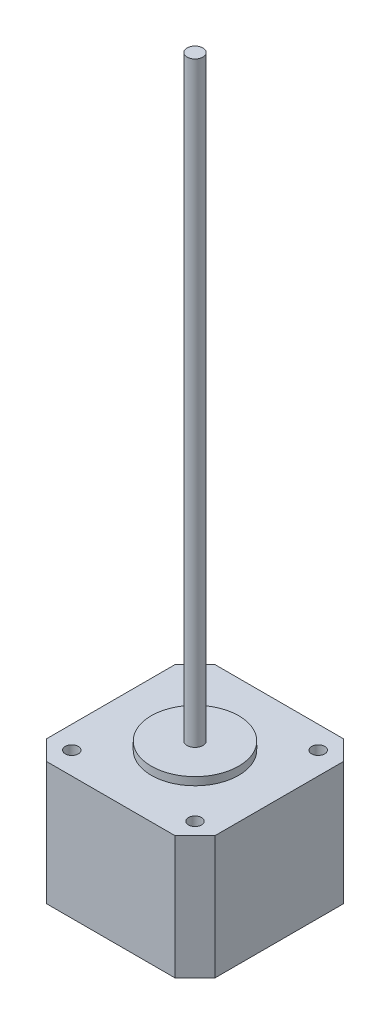
ISO-10303-21;
HEADER;
FILE_DESCRIPTION(('STEP AP214'),'2;1');
FILE_NAME('part.step','',(''),(''),'','','');
FILE_SCHEMA(('AUTOMOTIVE_DESIGN { 1 0 10303 214 1 1 1 1 }'));
ENDSEC;
DATA;
#1=APPLICATION_CONTEXT('core data for automotive mechanical design processes');
#2=APPLICATION_PROTOCOL_DEFINITION('international standard','automotive_design',2000,#1);
#3=PRODUCT_CONTEXT('',#1,'mechanical');
#4=PRODUCT('Part','Part','',(#3));
#5=PRODUCT_RELATED_PRODUCT_CATEGORY('part','',(#4));
#6=PRODUCT_DEFINITION_FORMATION('','',#4);
#7=PRODUCT_DEFINITION_CONTEXT('part definition',#1,'design');
#8=PRODUCT_DEFINITION('design','',#6,#7);
#9=PRODUCT_DEFINITION_SHAPE('','',#8);
#10=(LENGTH_UNIT() NAMED_UNIT(*) SI_UNIT(.MILLI.,.METRE.));
#11=(NAMED_UNIT(*) PLANE_ANGLE_UNIT() SI_UNIT($,.RADIAN.));
#12=(NAMED_UNIT(*) SI_UNIT($,.STERADIAN.) SOLID_ANGLE_UNIT());
#13=UNCERTAINTY_MEASURE_WITH_UNIT(LENGTH_MEASURE(1.E-05),#10,'distance_accuracy_value','');
#14=(GEOMETRIC_REPRESENTATION_CONTEXT(3) GLOBAL_UNCERTAINTY_ASSIGNED_CONTEXT((#13)) GLOBAL_UNIT_ASSIGNED_CONTEXT((#10,
#11,#12)) REPRESENTATION_CONTEXT('',''));
#15=CARTESIAN_POINT('',(0.,0.,0.));
#16=DIRECTION('',(0.,0.,1.));
#17=DIRECTION('',(1.,0.,0.));
#18=AXIS2_PLACEMENT_3D('',#15,#16,#17);
#19=CARTESIAN_POINT('',(0.,0.,-42.3));
#20=DIRECTION('',(0.,-1.,0.));
#21=DIRECTION('',(0.,0.,-1.));
#22=AXIS2_PLACEMENT_3D('',#19,#20,#21);
#23=PLANE('',#22);
#24=DIRECTION('',(0.,0.,-1.));
#25=VECTOR('',#24,1.);
#26=CARTESIAN_POINT('',(42.3,0.,0.));
#27=LINE('',#26,#25);
#28=CARTESIAN_POINT('',(42.3,0.,-4.99999999999999));
#29=VERTEX_POINT('',#28);
#30=CARTESIAN_POINT('',(42.3,0.,-37.3));
#31=VERTEX_POINT('',#30);
#32=EDGE_CURVE('E112',#29,#31,#27,.T.);
#33=ORIENTED_EDGE('',*,*,#32,.F.);
#34=DIRECTION('',(0.707106781186549,0.,-0.707106781186547));
#35=VECTOR('',#34,1.);
#36=CARTESIAN_POINT('',(39.7999999999999,0.,-2.49999999999994));
#37=LINE('',#36,#35);
#38=CARTESIAN_POINT('',(37.3,0.,0.));
#39=VERTEX_POINT('',#38);
#40=EDGE_CURVE('E95',#29,#39,#37,.F.);
#41=ORIENTED_EDGE('',*,*,#40,.T.);
#42=DIRECTION('',(1.,0.,0.));
#43=VECTOR('',#42,1.);
#44=CARTESIAN_POINT('',(0.,0.,0.));
#45=LINE('',#44,#43);
#46=CARTESIAN_POINT('',(5.,0.,0.));
#47=VERTEX_POINT('',#46);
#48=EDGE_CURVE('E121',#47,#39,#45,.T.);
#49=ORIENTED_EDGE('',*,*,#48,.F.);
#50=DIRECTION('',(0.707106781186547,0.,0.707106781186549));
#51=VECTOR('',#50,1.);
#52=CARTESIAN_POINT('',(-18.65,0.,-23.6500000000001));
#53=LINE('',#52,#51);
#54=CARTESIAN_POINT('',(0.,0.,-5.00000000000002));
#55=VERTEX_POINT('',#54);
#56=EDGE_CURVE('E106',#47,#55,#53,.F.);
#57=ORIENTED_EDGE('',*,*,#56,.T.);
#58=DIRECTION('',(0.,0.,1.));
#59=VECTOR('',#58,1.);
#60=CARTESIAN_POINT('',(0.,0.,0.));
#61=LINE('',#60,#59);
#62=CARTESIAN_POINT('',(0.,0.,-37.3));
#63=VERTEX_POINT('',#62);
#64=EDGE_CURVE('E125',#63,#55,#61,.T.);
#65=ORIENTED_EDGE('',*,*,#64,.F.);
#66=DIRECTION('',(-0.70710678118655,0.,0.707106781186546));
#67=VECTOR('',#66,1.);
#68=CARTESIAN_POINT('',(2.5,0.,-39.8));
#69=LINE('',#68,#67);
#70=CARTESIAN_POINT('',(5.00000000000002,0.,-42.3));
#71=VERTEX_POINT('',#70);
#72=EDGE_CURVE('E135',#63,#71,#69,.F.);
#73=ORIENTED_EDGE('',*,*,#72,.T.);
#74=DIRECTION('',(-1.,0.,0.));
#75=VECTOR('',#74,1.);
#76=CARTESIAN_POINT('',(0.,0.,-42.3));
#77=LINE('',#76,#75);
#78=CARTESIAN_POINT('',(37.3,0.,-42.3));
#79=VERTEX_POINT('',#78);
#80=EDGE_CURVE('E120',#79,#71,#77,.T.);
#81=ORIENTED_EDGE('',*,*,#80,.F.);
#82=DIRECTION('',(-0.707106781186546,0.,-0.70710678118655));
#83=VECTOR('',#82,1.);
#84=CARTESIAN_POINT('',(18.6500000000001,0.,-60.95));
#85=LINE('',#84,#83);
#86=EDGE_CURVE('E115',#79,#31,#85,.F.);
#87=ORIENTED_EDGE('',*,*,#86,.T.);
#88=EDGE_LOOP('',(#33,#41,#49,#57,#65,#73,#81,#87));
#89=FACE_BOUND('',#88,.T.);
#90=CARTESIAN_POINT('',(21.15,0.,-21.15));
#91=DIRECTION('',(0.,-1.,0.));
#92=DIRECTION('',(0.,0.,-1.));
#93=AXIS2_PLACEMENT_3D('',#90,#91,#92);
#94=CIRCLE('',#93,2.5);
#95=CARTESIAN_POINT('',(21.15,0.,-23.65));
#96=VERTEX_POINT('',#95);
#97=EDGE_CURVE('E211',#96,#96,#94,.T.);
#98=ORIENTED_EDGE('',*,*,#97,.F.);
#99=EDGE_LOOP('',(#98));
#100=FACE_BOUND('',#99,.T.);
#101=ADVANCED_FACE('F30',(#89,#100),#23,.T.);
#102=CARTESIAN_POINT('',(21.15,33.,-21.15));
#103=DIRECTION('',(0.,1.,0.));
#104=DIRECTION('',(0.,0.,1.));
#105=AXIS2_PLACEMENT_3D('',#102,#103,#104);
#106=PLANE('',#105);
#107=CARTESIAN_POINT('',(21.15,33.,-21.15));
#108=DIRECTION('',(0.,1.,0.));
#109=DIRECTION('',(0.,0.,1.));
#110=AXIS2_PLACEMENT_3D('',#107,#108,#109);
#111=CIRCLE('',#110,11.);
#112=CARTESIAN_POINT('',(21.15,33.,-10.15));
#113=VERTEX_POINT('',#112);
#114=EDGE_CURVE('E199',#113,#113,#111,.T.);
#115=ORIENTED_EDGE('',*,*,#114,.T.);
#116=EDGE_LOOP('',(#115));
#117=FACE_BOUND('',#116,.T.);
#118=CARTESIAN_POINT('',(21.15,33.,-21.15));
#119=DIRECTION('',(0.,1.,0.));
#120=DIRECTION('',(0.,0.,1.));
#121=AXIS2_PLACEMENT_3D('',#118,#119,#120);
#122=CIRCLE('',#121,2.);
#123=CARTESIAN_POINT('',(21.15,33.,-19.15));
#124=VERTEX_POINT('',#123);
#125=EDGE_CURVE('E205',#124,#124,#122,.T.);
#126=ORIENTED_EDGE('',*,*,#125,.F.);
#127=EDGE_LOOP('',(#126));
#128=FACE_BOUND('',#127,.T.);
#129=ADVANCED_FACE('F226',(#117,#128),#106,.T.);
#130=CARTESIAN_POINT('',(0.,31.,-42.3));
#131=DIRECTION('',(0.,-1.,0.));
#132=DIRECTION('',(0.,0.,-1.));
#133=AXIS2_PLACEMENT_3D('',#130,#131,#132);
#134=PLANE('',#133);
#135=DIRECTION('',(1.,0.,0.));
#136=VECTOR('',#135,1.);
#137=CARTESIAN_POINT('',(0.,31.,0.));
#138=LINE('',#137,#136);
#139=CARTESIAN_POINT('',(5.,31.,0.));
#140=VERTEX_POINT('',#139);
#141=CARTESIAN_POINT('',(37.3,31.,0.));
#142=VERTEX_POINT('',#141);
#143=EDGE_CURVE('E168',#140,#142,#138,.T.);
#144=ORIENTED_EDGE('',*,*,#143,.T.);
#145=DIRECTION('',(-0.707106781186549,0.,0.707106781186547));
#146=VECTOR('',#145,1.);
#147=CARTESIAN_POINT('',(42.3,31.,-5.));
#148=LINE('',#147,#146);
#149=CARTESIAN_POINT('',(42.3,31.,-5.));
#150=VERTEX_POINT('',#149);
#151=EDGE_CURVE('E146',#142,#150,#148,.F.);
#152=ORIENTED_EDGE('',*,*,#151,.T.);
#153=DIRECTION('',(0.,0.,-1.));
#154=VECTOR('',#153,1.);
#155=CARTESIAN_POINT('',(42.3,31.,0.));
#156=LINE('',#155,#154);
#157=CARTESIAN_POINT('',(42.3,31.,-37.3));
#158=VERTEX_POINT('',#157);
#159=EDGE_CURVE('E114',#150,#158,#156,.T.);
#160=ORIENTED_EDGE('',*,*,#159,.T.);
#161=DIRECTION('',(0.707106781186546,0.,0.70710678118655));
#162=VECTOR('',#161,1.);
#163=CARTESIAN_POINT('',(37.3,31.,-42.3));
#164=LINE('',#163,#162);
#165=CARTESIAN_POINT('',(37.3,31.,-42.3));
#166=VERTEX_POINT('',#165);
#167=EDGE_CURVE('E50',#158,#166,#164,.F.);
#168=ORIENTED_EDGE('',*,*,#167,.T.);
#169=DIRECTION('',(-1.,0.,0.));
#170=VECTOR('',#169,1.);
#171=CARTESIAN_POINT('',(0.,31.,-42.3));
#172=LINE('',#171,#170);
#173=CARTESIAN_POINT('',(5.00000000000002,31.,-42.3));
#174=VERTEX_POINT('',#173);
#175=EDGE_CURVE('E132',#166,#174,#172,.T.);
#176=ORIENTED_EDGE('',*,*,#175,.T.);
#177=DIRECTION('',(0.70710678118655,0.,-0.707106781186546));
#178=VECTOR('',#177,1.);
#179=CARTESIAN_POINT('',(0.,31.,-37.3));
#180=LINE('',#179,#178);
#181=CARTESIAN_POINT('',(0.,31.,-37.3));
#182=VERTEX_POINT('',#181);
#183=EDGE_CURVE('E142',#174,#182,#180,.F.);
#184=ORIENTED_EDGE('',*,*,#183,.T.);
#185=DIRECTION('',(0.,0.,1.));
#186=VECTOR('',#185,1.);
#187=CARTESIAN_POINT('',(0.,31.,0.));
#188=LINE('',#187,#186);
#189=CARTESIAN_POINT('',(0.,31.,-5.00000000000002));
#190=VERTEX_POINT('',#189);
#191=EDGE_CURVE('E123',#182,#190,#188,.T.);
#192=ORIENTED_EDGE('',*,*,#191,.T.);
#193=DIRECTION('',(-0.707106781186547,0.,-0.707106781186549));
#194=VECTOR('',#193,1.);
#195=CARTESIAN_POINT('',(5.,31.,0.));
#196=LINE('',#195,#194);
#197=EDGE_CURVE('E144',#190,#140,#196,.F.);
#198=ORIENTED_EDGE('',*,*,#197,.T.);
#199=EDGE_LOOP('',(#144,#152,#160,#168,#176,#184,#192,#198));
#200=FACE_BOUND('',#199,.T.);
#201=CARTESIAN_POINT('',(5.65,31.,-36.65));
#202=DIRECTION('',(0.,1.,0.));
#203=DIRECTION('',(0.,0.,1.));
#204=AXIS2_PLACEMENT_3D('',#201,#202,#203);
#205=CIRCLE('',#204,1.64447929425996);
#206=CARTESIAN_POINT('',(5.65,31.,-35.00552070574));
#207=VERTEX_POINT('',#206);
#208=EDGE_CURVE('E173',#207,#207,#205,.T.);
#209=ORIENTED_EDGE('',*,*,#208,.F.);
#210=EDGE_LOOP('',(#209));
#211=FACE_BOUND('',#210,.T.);
#212=CARTESIAN_POINT('',(36.65,31.,-36.6500000000002));
#213=DIRECTION('',(0.,1.,0.));
#214=DIRECTION('',(0.,0.,1.));
#215=AXIS2_PLACEMENT_3D('',#212,#213,#214);
#216=CIRCLE('',#215,1.64447929425996);
#217=CARTESIAN_POINT('',(36.65,31.,-35.0055207057403));
#218=VERTEX_POINT('',#217);
#219=EDGE_CURVE('E184',#218,#218,#216,.T.);
#220=ORIENTED_EDGE('',*,*,#219,.F.);
#221=EDGE_LOOP('',(#220));
#222=FACE_BOUND('',#221,.T.);
#223=CARTESIAN_POINT('',(5.65000000000011,31.,-5.65));
#224=DIRECTION('',(0.,1.,0.));
#225=DIRECTION('',(0.,0.,1.));
#226=AXIS2_PLACEMENT_3D('',#223,#224,#225);
#227=CIRCLE('',#226,1.64447929425996);
#228=CARTESIAN_POINT('',(5.65000000000011,31.,-4.00552070574004));
#229=VERTEX_POINT('',#228);
#230=EDGE_CURVE('E190',#229,#229,#227,.T.);
#231=ORIENTED_EDGE('',*,*,#230,.F.);
#232=EDGE_LOOP('',(#231));
#233=FACE_BOUND('',#232,.T.);
#234=CARTESIAN_POINT('',(36.6500000000001,31.,-5.65000000000022));
#235=DIRECTION('',(0.,1.,0.));
#236=DIRECTION('',(0.,0.,1.));
#237=AXIS2_PLACEMENT_3D('',#234,#235,#236);
#238=CIRCLE('',#237,1.64447929425996);
#239=CARTESIAN_POINT('',(36.6500000000001,31.,-4.00552070574025));
#240=VERTEX_POINT('',#239);
#241=EDGE_CURVE('E196',#240,#240,#238,.T.);
#242=ORIENTED_EDGE('',*,*,#241,.F.);
#243=EDGE_LOOP('',(#242));
#244=FACE_BOUND('',#243,.T.);
#245=CARTESIAN_POINT('',(21.15,31.,-21.15));
#246=DIRECTION('',(0.,-1.,0.));
#247=DIRECTION('',(0.,0.,-1.));
#248=AXIS2_PLACEMENT_3D('',#245,#246,#247);
#249=CIRCLE('',#248,11.);
#250=CARTESIAN_POINT('',(21.15,31.,-32.15));
#251=VERTEX_POINT('',#250);
#252=EDGE_CURVE('E129',#251,#251,#249,.F.);
#253=ORIENTED_EDGE('',*,*,#252,.F.);
#254=EDGE_LOOP('',(#253));
#255=FACE_BOUND('',#254,.T.);
#256=ADVANCED_FACE('F231',(#200,#211,#222,#233,#244,#255),#134,.F.);
#257=CARTESIAN_POINT('',(0.,31.,0.));
#258=DIRECTION('',(1.,0.,0.));
#259=DIRECTION('',(0.,0.,-1.));
#260=AXIS2_PLACEMENT_3D('',#257,#258,#259);
#261=PLANE('',#260);
#262=ORIENTED_EDGE('',*,*,#64,.T.);
#263=DIRECTION('',(0.,1.,0.));
#264=VECTOR('',#263,1.);
#265=CARTESIAN_POINT('',(0.,31.,-5.00000000000002));
#266=LINE('',#265,#264);
#267=EDGE_CURVE('E151',#55,#190,#266,.T.);
#268=ORIENTED_EDGE('',*,*,#267,.T.);
#269=ORIENTED_EDGE('',*,*,#191,.F.);
#270=DIRECTION('',(0.,-1.,0.));
#271=VECTOR('',#270,1.);
#272=CARTESIAN_POINT('',(0.,31.,-37.3));
#273=LINE('',#272,#271);
#274=EDGE_CURVE('E148',#182,#63,#273,.T.);
#275=ORIENTED_EDGE('',*,*,#274,.T.);
#276=EDGE_LOOP('',(#262,#268,#269,#275));
#277=FACE_BOUND('',#276,.T.);
#278=ADVANCED_FACE('F164',(#277),#261,.F.);
#279=CARTESIAN_POINT('',(0.,31.,0.));
#280=DIRECTION('',(0.,0.,-1.));
#281=DIRECTION('',(-1.,0.,0.));
#282=AXIS2_PLACEMENT_3D('',#279,#280,#281);
#283=PLANE('',#282);
#284=ORIENTED_EDGE('',*,*,#48,.T.);
#285=DIRECTION('',(0.,1.,0.));
#286=VECTOR('',#285,1.);
#287=CARTESIAN_POINT('',(37.3,31.,0.));
#288=LINE('',#287,#286);
#289=EDGE_CURVE('E100',#39,#142,#288,.T.);
#290=ORIENTED_EDGE('',*,*,#289,.T.);
#291=ORIENTED_EDGE('',*,*,#143,.F.);
#292=DIRECTION('',(0.,-1.,0.));
#293=VECTOR('',#292,1.);
#294=CARTESIAN_POINT('',(5.,31.,0.));
#295=LINE('',#294,#293);
#296=EDGE_CURVE('E105',#140,#47,#295,.T.);
#297=ORIENTED_EDGE('',*,*,#296,.T.);
#298=EDGE_LOOP('',(#284,#290,#291,#297));
#299=FACE_BOUND('',#298,.T.);
#300=ADVANCED_FACE('F242',(#299),#283,.F.);
#301=CARTESIAN_POINT('',(42.3,31.,0.));
#302=DIRECTION('',(-1.,0.,0.));
#303=DIRECTION('',(0.,0.,1.));
#304=AXIS2_PLACEMENT_3D('',#301,#302,#303);
#305=PLANE('',#304);
#306=ORIENTED_EDGE('',*,*,#159,.F.);
#307=DIRECTION('',(0.,-1.,0.));
#308=VECTOR('',#307,1.);
#309=CARTESIAN_POINT('',(42.3,31.,-5.));
#310=LINE('',#309,#308);
#311=EDGE_CURVE('E99',#150,#29,#310,.T.);
#312=ORIENTED_EDGE('',*,*,#311,.T.);
#313=ORIENTED_EDGE('',*,*,#32,.T.);
#314=DIRECTION('',(0.,1.,0.));
#315=VECTOR('',#314,1.);
#316=CARTESIAN_POINT('',(42.3,31.,-37.3));
#317=LINE('',#316,#315);
#318=EDGE_CURVE('E116',#31,#158,#317,.T.);
#319=ORIENTED_EDGE('',*,*,#318,.T.);
#320=EDGE_LOOP('',(#306,#312,#313,#319));
#321=FACE_BOUND('',#320,.T.);
#322=ADVANCED_FACE('F111',(#321),#305,.F.);
#323=CARTESIAN_POINT('',(0.,31.,-42.3));
#324=DIRECTION('',(0.,0.,1.));
#325=DIRECTION('',(1.,0.,0.));
#326=AXIS2_PLACEMENT_3D('',#323,#324,#325);
#327=PLANE('',#326);
#328=ORIENTED_EDGE('',*,*,#80,.T.);
#329=DIRECTION('',(0.,1.,0.));
#330=VECTOR('',#329,1.);
#331=CARTESIAN_POINT('',(5.00000000000002,31.,-42.3));
#332=LINE('',#331,#330);
#333=EDGE_CURVE('E11',#71,#174,#332,.T.);
#334=ORIENTED_EDGE('',*,*,#333,.T.);
#335=ORIENTED_EDGE('',*,*,#175,.F.);
#336=DIRECTION('',(0.,-1.,0.));
#337=VECTOR('',#336,1.);
#338=CARTESIAN_POINT('',(37.3,31.,-42.3));
#339=LINE('',#338,#337);
#340=EDGE_CURVE('E38',#166,#79,#339,.T.);
#341=ORIENTED_EDGE('',*,*,#340,.T.);
#342=EDGE_LOOP('',(#328,#334,#335,#341));
#343=FACE_BOUND('',#342,.T.);
#344=ADVANCED_FACE('F154',(#343),#327,.F.);
#345=CARTESIAN_POINT('',(5.65,21.,-36.65));
#346=DIRECTION('',(0.,1.,0.));
#347=DIRECTION('',(0.,0.,1.));
#348=AXIS2_PLACEMENT_3D('',#345,#346,#347);
#349=CYLINDRICAL_SURFACE('',#348,1.64447929425996);
#350=CARTESIAN_POINT('',(5.65,21.,-36.65));
#351=DIRECTION('',(0.,1.,0.));
#352=DIRECTION('',(0.,0.,1.));
#353=AXIS2_PLACEMENT_3D('',#350,#351,#352);
#354=CIRCLE('',#353,1.64447929425996);
#355=CARTESIAN_POINT('',(5.65,21.,-35.00552070574));
#356=VERTEX_POINT('',#355);
#357=EDGE_CURVE('E177',#356,#356,#354,.T.);
#358=ORIENTED_EDGE('',*,*,#357,.F.);
#359=EDGE_LOOP('',(#358));
#360=FACE_BOUND('',#359,.T.);
#361=ORIENTED_EDGE('',*,*,#208,.T.);
#362=EDGE_LOOP('',(#361));
#363=FACE_BOUND('',#362,.T.);
#364=ADVANCED_FACE('F239',(#360,#363),#349,.F.);
#365=CARTESIAN_POINT('',(5.65,21.,-36.65));
#366=DIRECTION('',(0.,1.,0.));
#367=DIRECTION('',(0.,0.,1.));
#368=AXIS2_PLACEMENT_3D('',#365,#366,#367);
#369=PLANE('',#368);
#370=ORIENTED_EDGE('',*,*,#357,.T.);
#371=EDGE_LOOP('',(#370));
#372=FACE_BOUND('',#371,.T.);
#373=ADVANCED_FACE('F308',(#372),#369,.T.);
#374=CARTESIAN_POINT('',(36.65,21.,-36.6500000000002));
#375=DIRECTION('',(0.,1.,0.));
#376=DIRECTION('',(0.,0.,1.));
#377=AXIS2_PLACEMENT_3D('',#374,#375,#376);
#378=CYLINDRICAL_SURFACE('',#377,1.64447929425996);
#379=CARTESIAN_POINT('',(36.65,21.,-36.6500000000002));
#380=DIRECTION('',(0.,1.,0.));
#381=DIRECTION('',(0.,0.,1.));
#382=AXIS2_PLACEMENT_3D('',#379,#380,#381);
#383=CIRCLE('',#382,1.64447929425996);
#384=CARTESIAN_POINT('',(36.65,21.,-35.0055207057403));
#385=VERTEX_POINT('',#384);
#386=EDGE_CURVE('E182',#385,#385,#383,.T.);
#387=ORIENTED_EDGE('',*,*,#386,.F.);
#388=EDGE_LOOP('',(#387));
#389=FACE_BOUND('',#388,.T.);
#390=ORIENTED_EDGE('',*,*,#219,.T.);
#391=EDGE_LOOP('',(#390));
#392=FACE_BOUND('',#391,.T.);
#393=ADVANCED_FACE('F304',(#389,#392),#378,.F.);
#394=CARTESIAN_POINT('',(36.65,21.,-36.6500000000002));
#395=DIRECTION('',(0.,1.,0.));
#396=DIRECTION('',(0.,0.,1.));
#397=AXIS2_PLACEMENT_3D('',#394,#395,#396);
#398=PLANE('',#397);
#399=ORIENTED_EDGE('',*,*,#386,.T.);
#400=EDGE_LOOP('',(#399));
#401=FACE_BOUND('',#400,.T.);
#402=ADVANCED_FACE('F300',(#401),#398,.T.);
#403=CARTESIAN_POINT('',(5.65000000000011,21.,-5.65));
#404=DIRECTION('',(0.,1.,0.));
#405=DIRECTION('',(0.,0.,1.));
#406=AXIS2_PLACEMENT_3D('',#403,#404,#405);
#407=CYLINDRICAL_SURFACE('',#406,1.64447929425996);
#408=CARTESIAN_POINT('',(5.65000000000011,21.,-5.65));
#409=DIRECTION('',(0.,1.,0.));
#410=DIRECTION('',(0.,0.,1.));
#411=AXIS2_PLACEMENT_3D('',#408,#409,#410);
#412=CIRCLE('',#411,1.64447929425996);
#413=CARTESIAN_POINT('',(5.65000000000011,21.,-4.00552070574004));
#414=VERTEX_POINT('',#413);
#415=EDGE_CURVE('E187',#414,#414,#412,.T.);
#416=ORIENTED_EDGE('',*,*,#415,.F.);
#417=EDGE_LOOP('',(#416));
#418=FACE_BOUND('',#417,.T.);
#419=ORIENTED_EDGE('',*,*,#230,.T.);
#420=EDGE_LOOP('',(#419));
#421=FACE_BOUND('',#420,.T.);
#422=ADVANCED_FACE('F296',(#418,#421),#407,.F.);
#423=CARTESIAN_POINT('',(5.65000000000011,21.,-5.65));
#424=DIRECTION('',(0.,1.,0.));
#425=DIRECTION('',(0.,0.,1.));
#426=AXIS2_PLACEMENT_3D('',#423,#424,#425);
#427=PLANE('',#426);
#428=ORIENTED_EDGE('',*,*,#415,.T.);
#429=EDGE_LOOP('',(#428));
#430=FACE_BOUND('',#429,.T.);
#431=ADVANCED_FACE('F292',(#430),#427,.T.);
#432=CARTESIAN_POINT('',(36.6500000000001,21.,-5.65000000000022));
#433=DIRECTION('',(0.,1.,0.));
#434=DIRECTION('',(0.,0.,1.));
#435=AXIS2_PLACEMENT_3D('',#432,#433,#434);
#436=CYLINDRICAL_SURFACE('',#435,1.64447929425996);
#437=CARTESIAN_POINT('',(36.6500000000001,21.,-5.65000000000022));
#438=DIRECTION('',(0.,1.,0.));
#439=DIRECTION('',(0.,0.,1.));
#440=AXIS2_PLACEMENT_3D('',#437,#438,#439);
#441=CIRCLE('',#440,1.64447929425996);
#442=CARTESIAN_POINT('',(36.6500000000001,21.,-4.00552070574025));
#443=VERTEX_POINT('',#442);
#444=EDGE_CURVE('E193',#443,#443,#441,.T.);
#445=ORIENTED_EDGE('',*,*,#444,.F.);
#446=EDGE_LOOP('',(#445));
#447=FACE_BOUND('',#446,.T.);
#448=ORIENTED_EDGE('',*,*,#241,.T.);
#449=EDGE_LOOP('',(#448));
#450=FACE_BOUND('',#449,.T.);
#451=ADVANCED_FACE('F285',(#447,#450),#436,.F.);
#452=CARTESIAN_POINT('',(36.6500000000001,21.,-5.65000000000022));
#453=DIRECTION('',(0.,1.,0.));
#454=DIRECTION('',(0.,0.,1.));
#455=AXIS2_PLACEMENT_3D('',#452,#453,#454);
#456=PLANE('',#455);
#457=ORIENTED_EDGE('',*,*,#444,.T.);
#458=EDGE_LOOP('',(#457));
#459=FACE_BOUND('',#458,.T.);
#460=ADVANCED_FACE('F279',(#459),#456,.T.);
#461=CARTESIAN_POINT('',(21.15,33.,-21.15));
#462=DIRECTION('',(0.,-1.,0.));
#463=DIRECTION('',(0.,0.,-1.));
#464=AXIS2_PLACEMENT_3D('',#461,#462,#463);
#465=CYLINDRICAL_SURFACE('',#464,11.);
#466=ORIENTED_EDGE('',*,*,#114,.F.);
#467=EDGE_LOOP('',(#466));
#468=FACE_BOUND('',#467,.T.);
#469=ORIENTED_EDGE('',*,*,#252,.T.);
#470=EDGE_LOOP('',(#469));
#471=FACE_BOUND('',#470,.T.);
#472=ADVANCED_FACE('F251',(#468,#471),#465,.T.);
#473=CARTESIAN_POINT('',(42.3,31.,-5.));
#474=DIRECTION('',(-0.707106781186547,0.,-0.707106781186549));
#475=DIRECTION('',(-0.707106781186549,0.,0.707106781186547));
#476=AXIS2_PLACEMENT_3D('',#473,#474,#475);
#477=PLANE('',#476);
#478=ORIENTED_EDGE('',*,*,#151,.F.);
#479=ORIENTED_EDGE('',*,*,#289,.F.);
#480=ORIENTED_EDGE('',*,*,#40,.F.);
#481=ORIENTED_EDGE('',*,*,#311,.F.);
#482=EDGE_LOOP('',(#478,#479,#480,#481));
#483=FACE_BOUND('',#482,.T.);
#484=ADVANCED_FACE('F98',(#483),#477,.F.);
#485=CARTESIAN_POINT('',(5.,31.,0.));
#486=DIRECTION('',(0.707106781186549,0.,-0.707106781186547));
#487=DIRECTION('',(-0.707106781186547,0.,-0.707106781186549));
#488=AXIS2_PLACEMENT_3D('',#485,#486,#487);
#489=PLANE('',#488);
#490=ORIENTED_EDGE('',*,*,#197,.F.);
#491=ORIENTED_EDGE('',*,*,#267,.F.);
#492=ORIENTED_EDGE('',*,*,#56,.F.);
#493=ORIENTED_EDGE('',*,*,#296,.F.);
#494=EDGE_LOOP('',(#490,#491,#492,#493));
#495=FACE_BOUND('',#494,.T.);
#496=ADVANCED_FACE('F250',(#495),#489,.F.);
#497=CARTESIAN_POINT('',(0.,31.,-37.3));
#498=DIRECTION('',(0.707106781186545,0.,0.707106781186549));
#499=DIRECTION('',(0.70710678118655,0.,-0.707106781186546));
#500=AXIS2_PLACEMENT_3D('',#497,#498,#499);
#501=PLANE('',#500);
#502=ORIENTED_EDGE('',*,*,#183,.F.);
#503=ORIENTED_EDGE('',*,*,#333,.F.);
#504=ORIENTED_EDGE('',*,*,#72,.F.);
#505=ORIENTED_EDGE('',*,*,#274,.F.);
#506=EDGE_LOOP('',(#502,#503,#504,#505));
#507=FACE_BOUND('',#506,.T.);
#508=ADVANCED_FACE('F161',(#507),#501,.F.);
#509=CARTESIAN_POINT('',(37.3,31.,-42.3));
#510=DIRECTION('',(-0.707106781186549,0.,0.707106781186545));
#511=DIRECTION('',(0.707106781186546,0.,0.70710678118655));
#512=AXIS2_PLACEMENT_3D('',#509,#510,#511);
#513=PLANE('',#512);
#514=ORIENTED_EDGE('',*,*,#167,.F.);
#515=ORIENTED_EDGE('',*,*,#318,.F.);
#516=ORIENTED_EDGE('',*,*,#86,.F.);
#517=ORIENTED_EDGE('',*,*,#340,.F.);
#518=EDGE_LOOP('',(#514,#515,#516,#517));
#519=FACE_BOUND('',#518,.T.);
#520=ADVANCED_FACE('F32',(#519),#513,.F.);
#521=CARTESIAN_POINT('',(21.15,183.,-21.15));
#522=DIRECTION('',(0.,-1.,0.));
#523=DIRECTION('',(0.,0.,-1.));
#524=AXIS2_PLACEMENT_3D('',#521,#522,#523);
#525=CYLINDRICAL_SURFACE('',#524,2.);
#526=CARTESIAN_POINT('',(21.15,183.,-21.15));
#527=DIRECTION('',(0.,1.,0.));
#528=DIRECTION('',(0.,0.,1.));
#529=AXIS2_PLACEMENT_3D('',#526,#527,#528);
#530=CIRCLE('',#529,2.);
#531=CARTESIAN_POINT('',(21.15,183.,-19.15));
#532=VERTEX_POINT('',#531);
#533=EDGE_CURVE('E204',#532,#532,#530,.T.);
#534=ORIENTED_EDGE('',*,*,#533,.F.);
#535=EDGE_LOOP('',(#534));
#536=FACE_BOUND('',#535,.T.);
#537=ORIENTED_EDGE('',*,*,#125,.T.);
#538=EDGE_LOOP('',(#537));
#539=FACE_BOUND('',#538,.T.);
#540=ADVANCED_FACE('F258',(#536,#539),#525,.T.);
#541=CARTESIAN_POINT('',(21.15,183.,-21.15));
#542=DIRECTION('',(0.,1.,0.));
#543=DIRECTION('',(0.,0.,1.));
#544=AXIS2_PLACEMENT_3D('',#541,#542,#543);
#545=PLANE('',#544);
#546=ORIENTED_EDGE('',*,*,#533,.T.);
#547=EDGE_LOOP('',(#546));
#548=FACE_BOUND('',#547,.T.);
#549=ADVANCED_FACE('F222',(#548),#545,.T.);
#550=CARTESIAN_POINT('',(21.15,-13.5,-21.15));
#551=DIRECTION('',(0.,1.,0.));
#552=DIRECTION('',(0.,0.,1.));
#553=AXIS2_PLACEMENT_3D('',#550,#551,#552);
#554=CYLINDRICAL_SURFACE('',#553,2.5);
#555=CARTESIAN_POINT('',(21.15,-13.5,-21.15));
#556=DIRECTION('',(0.,-1.,0.));
#557=DIRECTION('',(0.,0.,-1.));
#558=AXIS2_PLACEMENT_3D('',#555,#556,#557);
#559=CIRCLE('',#558,2.5);
#560=CARTESIAN_POINT('',(21.15,-13.5,-23.65));
#561=VERTEX_POINT('',#560);
#562=EDGE_CURVE('E208',#561,#561,#559,.T.);
#563=ORIENTED_EDGE('',*,*,#562,.F.);
#564=EDGE_LOOP('',(#563));
#565=FACE_BOUND('',#564,.T.);
#566=ORIENTED_EDGE('',*,*,#97,.T.);
#567=EDGE_LOOP('',(#566));
#568=FACE_BOUND('',#567,.T.);
#569=ADVANCED_FACE('F219',(#565,#568),#554,.T.);
#570=CARTESIAN_POINT('',(21.15,-13.5,-21.15));
#571=DIRECTION('',(0.,-1.,0.));
#572=DIRECTION('',(0.,0.,-1.));
#573=AXIS2_PLACEMENT_3D('',#570,#571,#572);
#574=PLANE('',#573);
#575=ORIENTED_EDGE('',*,*,#562,.T.);
#576=EDGE_LOOP('',(#575));
#577=FACE_BOUND('',#576,.T.);
#578=ADVANCED_FACE('F217',(#577),#574,.T.);
#579=CLOSED_SHELL('',(#101,#129,#256,#278,#300,#322,#344,#364,#373,#393,#402,#422,#431,#451,
#460,#472,#484,#496,#508,#520,#540,#549,#569,#578));
#580=MANIFOLD_SOLID_BREP('B2',#579);
#581=ADVANCED_BREP_SHAPE_REPRESENTATION('',(#18,#580),#14);
#582=SHAPE_DEFINITION_REPRESENTATION(#9,#581);
ENDSEC;
END-ISO-10303-21;
